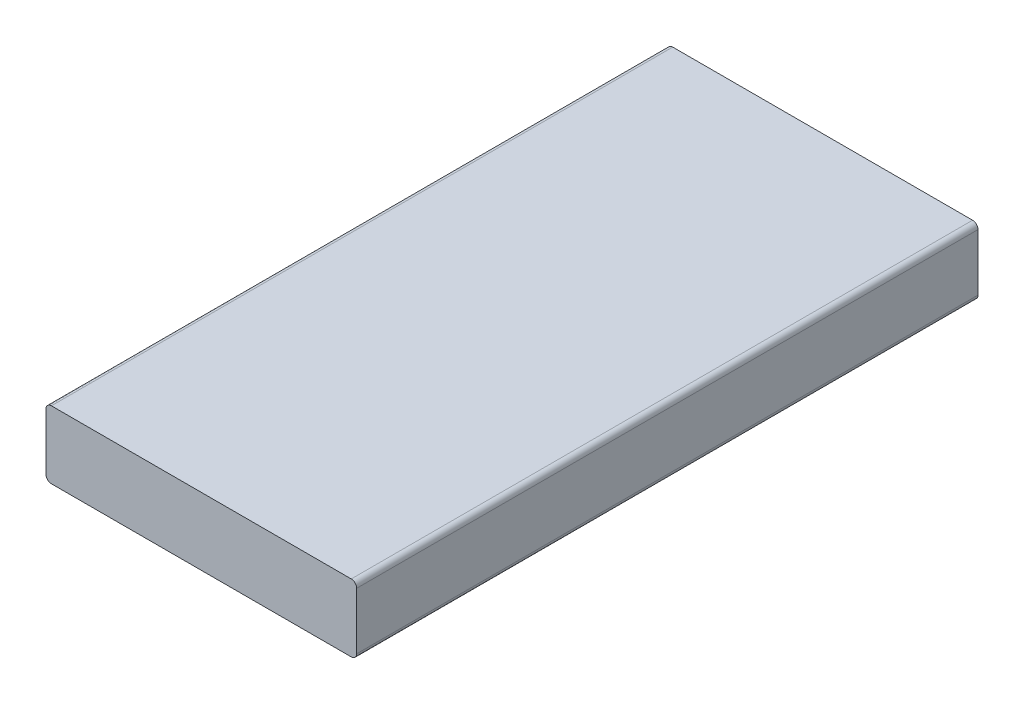
ISO-10303-21;
HEADER;
FILE_DESCRIPTION(('STEP AP214'),'2;1');
FILE_NAME('part.step','',(''),(''),'','','');
FILE_SCHEMA(('AUTOMOTIVE_DESIGN { 1 0 10303 214 1 1 1 1 }'));
ENDSEC;
DATA;
#1=APPLICATION_CONTEXT('core data for automotive mechanical design processes');
#2=APPLICATION_PROTOCOL_DEFINITION('international standard','automotive_design',2000,#1);
#3=PRODUCT_CONTEXT('',#1,'mechanical');
#4=PRODUCT('Part','Part','',(#3));
#5=PRODUCT_RELATED_PRODUCT_CATEGORY('part','',(#4));
#6=PRODUCT_DEFINITION_FORMATION('','',#4);
#7=PRODUCT_DEFINITION_CONTEXT('part definition',#1,'design');
#8=PRODUCT_DEFINITION('design','',#6,#7);
#9=PRODUCT_DEFINITION_SHAPE('','',#8);
#10=(LENGTH_UNIT() NAMED_UNIT(*) SI_UNIT(.MILLI.,.METRE.));
#11=(NAMED_UNIT(*) PLANE_ANGLE_UNIT() SI_UNIT($,.RADIAN.));
#12=(NAMED_UNIT(*) SI_UNIT($,.STERADIAN.) SOLID_ANGLE_UNIT());
#13=UNCERTAINTY_MEASURE_WITH_UNIT(LENGTH_MEASURE(1.E-05),#10,'distance_accuracy_value','');
#14=(GEOMETRIC_REPRESENTATION_CONTEXT(3) GLOBAL_UNCERTAINTY_ASSIGNED_CONTEXT((#13)) GLOBAL_UNIT_ASSIGNED_CONTEXT((#10,
#11,#12)) REPRESENTATION_CONTEXT('',''));
#15=CARTESIAN_POINT('',(0.,0.,0.));
#16=DIRECTION('',(0.,0.,1.));
#17=DIRECTION('',(1.,0.,0.));
#18=AXIS2_PLACEMENT_3D('',#15,#16,#17);
#19=CARTESIAN_POINT('',(-29.3402777777778,15.8854166666667,-230.));
#20=DIRECTION('',(-1.,0.,0.));
#21=DIRECTION('',(0.,0.,1.));
#22=AXIS2_PLACEMENT_3D('',#19,#20,#21);
#23=PLANE('',#22);
#24=DIRECTION('',(0.,-1.,0.));
#25=VECTOR('',#24,1.);
#26=CARTESIAN_POINT('',(-29.3402777777778,15.8854166666667,-230.));
#27=LINE('',#26,#25);
#28=CARTESIAN_POINT('',(-29.3402777777778,13.8854166666667,-230.));
#29=VERTEX_POINT('',#28);
#30=CARTESIAN_POINT('',(-29.3402777777778,-7.11458333333333,-230.));
#31=VERTEX_POINT('',#30);
#32=EDGE_CURVE('E179',#29,#31,#27,.T.);
#33=ORIENTED_EDGE('',*,*,#32,.T.);
#34=DIRECTION('',(0.,0.,1.));
#35=VECTOR('',#34,1.);
#36=CARTESIAN_POINT('',(-29.3402777777778,-7.11458333333333,-230.));
#37=LINE('',#36,#35);
#38=CARTESIAN_POINT('',(-29.3402777777778,-7.11458333333333,0.));
#39=VERTEX_POINT('',#38);
#40=EDGE_CURVE('E11',#31,#39,#37,.T.);
#41=ORIENTED_EDGE('',*,*,#40,.T.);
#42=DIRECTION('',(0.,-1.,0.));
#43=VECTOR('',#42,1.);
#44=CARTESIAN_POINT('',(-29.3402777777778,15.8854166666667,0.));
#45=LINE('',#44,#43);
#46=CARTESIAN_POINT('',(-29.3402777777778,13.8854166666667,0.));
#47=VERTEX_POINT('',#46);
#48=EDGE_CURVE('E112',#47,#39,#45,.T.);
#49=ORIENTED_EDGE('',*,*,#48,.F.);
#50=DIRECTION('',(0.,0.,1.));
#51=VECTOR('',#50,1.);
#52=CARTESIAN_POINT('',(-29.3402777777778,13.8854166666667,-230.));
#53=LINE('',#52,#51);
#54=EDGE_CURVE('E48',#47,#29,#53,.F.);
#55=ORIENTED_EDGE('',*,*,#54,.T.);
#56=EDGE_LOOP('',(#33,#41,#49,#55));
#57=FACE_BOUND('',#56,.T.);
#58=ADVANCED_FACE('F39',(#57),#23,.T.);
#59=CARTESIAN_POINT('',(-29.3402777777778,15.8854166666667,-230.));
#60=DIRECTION('',(0.,1.,0.));
#61=DIRECTION('',(0.,0.,1.));
#62=AXIS2_PLACEMENT_3D('',#59,#60,#61);
#63=PLANE('',#62);
#64=DIRECTION('',(-1.,0.,0.));
#65=VECTOR('',#64,1.);
#66=CARTESIAN_POINT('',(-29.3402777777778,15.8854166666667,0.));
#67=LINE('',#66,#65);
#68=CARTESIAN_POINT('',(83.6597222222222,15.8854166666667,0.));
#69=VERTEX_POINT('',#68);
#70=CARTESIAN_POINT('',(-27.3402777777778,15.8854166666667,0.));
#71=VERTEX_POINT('',#70);
#72=EDGE_CURVE('E143',#69,#71,#67,.T.);
#73=ORIENTED_EDGE('',*,*,#72,.F.);
#74=DIRECTION('',(0.,0.,1.));
#75=VECTOR('',#74,1.);
#76=CARTESIAN_POINT('',(83.6597222222222,15.8854166666667,-230.));
#77=LINE('',#76,#75);
#78=CARTESIAN_POINT('',(83.6597222222222,15.8854166666667,-230.));
#79=VERTEX_POINT('',#78);
#80=EDGE_CURVE('E62',#69,#79,#77,.F.);
#81=ORIENTED_EDGE('',*,*,#80,.T.);
#82=DIRECTION('',(-1.,0.,0.));
#83=VECTOR('',#82,1.);
#84=CARTESIAN_POINT('',(-29.3402777777778,15.8854166666667,-230.));
#85=LINE('',#84,#83);
#86=CARTESIAN_POINT('',(-27.3402777777778,15.8854166666667,-230.));
#87=VERTEX_POINT('',#86);
#88=EDGE_CURVE('E135',#79,#87,#85,.T.);
#89=ORIENTED_EDGE('',*,*,#88,.T.);
#90=DIRECTION('',(0.,0.,1.));
#91=VECTOR('',#90,1.);
#92=CARTESIAN_POINT('',(-27.3402777777778,15.8854166666667,-230.));
#93=LINE('',#92,#91);
#94=EDGE_CURVE('E170',#87,#71,#93,.T.);
#95=ORIENTED_EDGE('',*,*,#94,.T.);
#96=EDGE_LOOP('',(#73,#81,#89,#95));
#97=FACE_BOUND('',#96,.T.);
#98=ADVANCED_FACE('F188',(#97),#63,.T.);
#99=CARTESIAN_POINT('',(85.6597222222222,15.8854166666667,-230.));
#100=DIRECTION('',(1.,0.,0.));
#101=DIRECTION('',(0.,0.,-1.));
#102=AXIS2_PLACEMENT_3D('',#99,#100,#101);
#103=PLANE('',#102);
#104=DIRECTION('',(0.,1.,0.));
#105=VECTOR('',#104,1.);
#106=CARTESIAN_POINT('',(85.6597222222222,15.8854166666667,0.));
#107=LINE('',#106,#105);
#108=CARTESIAN_POINT('',(85.6597222222222,-7.11458333333333,0.));
#109=VERTEX_POINT('',#108);
#110=CARTESIAN_POINT('',(85.6597222222222,13.8854166666667,0.));
#111=VERTEX_POINT('',#110);
#112=EDGE_CURVE('E129',#109,#111,#107,.T.);
#113=ORIENTED_EDGE('',*,*,#112,.F.);
#114=DIRECTION('',(0.,0.,1.));
#115=VECTOR('',#114,1.);
#116=CARTESIAN_POINT('',(85.6597222222222,-7.11458333333333,-230.));
#117=LINE('',#116,#115);
#118=CARTESIAN_POINT('',(85.6597222222222,-7.11458333333333,-230.));
#119=VERTEX_POINT('',#118);
#120=EDGE_CURVE('E157',#109,#119,#117,.F.);
#121=ORIENTED_EDGE('',*,*,#120,.T.);
#122=DIRECTION('',(0.,1.,0.));
#123=VECTOR('',#122,1.);
#124=CARTESIAN_POINT('',(85.6597222222222,15.8854166666667,-230.));
#125=LINE('',#124,#123);
#126=CARTESIAN_POINT('',(85.6597222222222,13.8854166666667,-230.));
#127=VERTEX_POINT('',#126);
#128=EDGE_CURVE('E140',#119,#127,#125,.T.);
#129=ORIENTED_EDGE('',*,*,#128,.T.);
#130=DIRECTION('',(0.,0.,1.));
#131=VECTOR('',#130,1.);
#132=CARTESIAN_POINT('',(85.6597222222222,13.8854166666667,-230.));
#133=LINE('',#132,#131);
#134=EDGE_CURVE('E153',#127,#111,#133,.T.);
#135=ORIENTED_EDGE('',*,*,#134,.T.);
#136=EDGE_LOOP('',(#113,#121,#129,#135));
#137=FACE_BOUND('',#136,.T.);
#138=ADVANCED_FACE('F205',(#137),#103,.T.);
#139=CARTESIAN_POINT('',(-29.3402777777778,-9.11458333333333,-230.));
#140=DIRECTION('',(0.,-1.,0.));
#141=DIRECTION('',(0.,0.,-1.));
#142=AXIS2_PLACEMENT_3D('',#139,#140,#141);
#143=PLANE('',#142);
#144=DIRECTION('',(1.,0.,0.));
#145=VECTOR('',#144,1.);
#146=CARTESIAN_POINT('',(-29.3402777777778,-9.11458333333333,-230.));
#147=LINE('',#146,#145);
#148=CARTESIAN_POINT('',(-27.3402777777778,-9.11458333333333,-230.));
#149=VERTEX_POINT('',#148);
#150=CARTESIAN_POINT('',(83.6597222222222,-9.11458333333333,-230.));
#151=VERTEX_POINT('',#150);
#152=EDGE_CURVE('E184',#149,#151,#147,.T.);
#153=ORIENTED_EDGE('',*,*,#152,.T.);
#154=DIRECTION('',(0.,0.,1.));
#155=VECTOR('',#154,1.);
#156=CARTESIAN_POINT('',(83.6597222222222,-9.11458333333333,-230.));
#157=LINE('',#156,#155);
#158=CARTESIAN_POINT('',(83.6597222222222,-9.11458333333333,0.));
#159=VERTEX_POINT('',#158);
#160=EDGE_CURVE('E127',#151,#159,#157,.T.);
#161=ORIENTED_EDGE('',*,*,#160,.T.);
#162=DIRECTION('',(1.,0.,0.));
#163=VECTOR('',#162,1.);
#164=CARTESIAN_POINT('',(-29.3402777777778,-9.11458333333333,0.));
#165=LINE('',#164,#163);
#166=CARTESIAN_POINT('',(-27.3402777777778,-9.11458333333333,0.));
#167=VERTEX_POINT('',#166);
#168=EDGE_CURVE('E110',#167,#159,#165,.T.);
#169=ORIENTED_EDGE('',*,*,#168,.F.);
#170=DIRECTION('',(0.,0.,1.));
#171=VECTOR('',#170,1.);
#172=CARTESIAN_POINT('',(-27.3402777777778,-9.11458333333333,-230.));
#173=LINE('',#172,#171);
#174=EDGE_CURVE('E124',#167,#149,#173,.F.);
#175=ORIENTED_EDGE('',*,*,#174,.T.);
#176=EDGE_LOOP('',(#153,#161,#169,#175));
#177=FACE_BOUND('',#176,.T.);
#178=ADVANCED_FACE('F123',(#177),#143,.T.);
#179=CARTESIAN_POINT('',(0.,0.,-230.));
#180=DIRECTION('',(0.,0.,1.));
#181=DIRECTION('',(1.,0.,0.));
#182=AXIS2_PLACEMENT_3D('',#179,#180,#181);
#183=PLANE('',#182);
#184=ORIENTED_EDGE('',*,*,#128,.F.);
#185=CARTESIAN_POINT('',(83.6597222222222,-7.11458333333333,-230.));
#186=DIRECTION('',(0.,0.,1.));
#187=DIRECTION('',(1.,0.,0.));
#188=AXIS2_PLACEMENT_3D('',#185,#186,#187);
#189=CIRCLE('',#188,2.);
#190=EDGE_CURVE('E167',#119,#151,#189,.F.);
#191=ORIENTED_EDGE('',*,*,#190,.T.);
#192=ORIENTED_EDGE('',*,*,#152,.F.);
#193=CARTESIAN_POINT('',(-27.3402777777778,-7.11458333333333,-230.));
#194=DIRECTION('',(0.,0.,1.));
#195=DIRECTION('',(1.,0.,0.));
#196=AXIS2_PLACEMENT_3D('',#193,#194,#195);
#197=CIRCLE('',#196,2.);
#198=EDGE_CURVE('E133',#149,#31,#197,.F.);
#199=ORIENTED_EDGE('',*,*,#198,.T.);
#200=ORIENTED_EDGE('',*,*,#32,.F.);
#201=CARTESIAN_POINT('',(-27.3402777777778,13.8854166666667,-230.));
#202=DIRECTION('',(0.,0.,1.));
#203=DIRECTION('',(1.,0.,0.));
#204=AXIS2_PLACEMENT_3D('',#201,#202,#203);
#205=CIRCLE('',#204,2.);
#206=EDGE_CURVE('E55',#29,#87,#205,.F.);
#207=ORIENTED_EDGE('',*,*,#206,.T.);
#208=ORIENTED_EDGE('',*,*,#88,.F.);
#209=CARTESIAN_POINT('',(83.6597222222222,13.8854166666667,-230.));
#210=DIRECTION('',(0.,0.,1.));
#211=DIRECTION('',(1.,0.,0.));
#212=AXIS2_PLACEMENT_3D('',#209,#210,#211);
#213=CIRCLE('',#212,2.);
#214=EDGE_CURVE('E164',#79,#127,#213,.F.);
#215=ORIENTED_EDGE('',*,*,#214,.T.);
#216=EDGE_LOOP('',(#184,#191,#192,#199,#200,#207,#208,#215));
#217=FACE_BOUND('',#216,.T.);
#218=ADVANCED_FACE('F182',(#217),#183,.F.);
#219=CARTESIAN_POINT('',(0.,0.,0.));
#220=DIRECTION('',(0.,0.,1.));
#221=DIRECTION('',(1.,0.,0.));
#222=AXIS2_PLACEMENT_3D('',#219,#220,#221);
#223=PLANE('',#222);
#224=ORIENTED_EDGE('',*,*,#168,.T.);
#225=CARTESIAN_POINT('',(83.6597222222222,-7.11458333333333,0.));
#226=DIRECTION('',(0.,0.,1.));
#227=DIRECTION('',(1.,0.,0.));
#228=AXIS2_PLACEMENT_3D('',#225,#226,#227);
#229=CIRCLE('',#228,2.);
#230=EDGE_CURVE('E150',#159,#109,#229,.T.);
#231=ORIENTED_EDGE('',*,*,#230,.T.);
#232=ORIENTED_EDGE('',*,*,#112,.T.);
#233=CARTESIAN_POINT('',(83.6597222222222,13.8854166666667,0.));
#234=DIRECTION('',(0.,0.,1.));
#235=DIRECTION('',(1.,0.,0.));
#236=AXIS2_PLACEMENT_3D('',#233,#234,#235);
#237=CIRCLE('',#236,2.);
#238=EDGE_CURVE('E117',#111,#69,#237,.T.);
#239=ORIENTED_EDGE('',*,*,#238,.T.);
#240=ORIENTED_EDGE('',*,*,#72,.T.);
#241=CARTESIAN_POINT('',(-27.3402777777778,13.8854166666667,0.));
#242=DIRECTION('',(0.,0.,1.));
#243=DIRECTION('',(1.,0.,0.));
#244=AXIS2_PLACEMENT_3D('',#241,#242,#243);
#245=CIRCLE('',#244,2.);
#246=EDGE_CURVE('E118',#71,#47,#245,.T.);
#247=ORIENTED_EDGE('',*,*,#246,.T.);
#248=ORIENTED_EDGE('',*,*,#48,.T.);
#249=CARTESIAN_POINT('',(-27.3402777777778,-7.11458333333333,0.));
#250=DIRECTION('',(0.,0.,1.));
#251=DIRECTION('',(1.,0.,0.));
#252=AXIS2_PLACEMENT_3D('',#249,#250,#251);
#253=CIRCLE('',#252,2.);
#254=EDGE_CURVE('E107',#39,#167,#253,.T.);
#255=ORIENTED_EDGE('',*,*,#254,.T.);
#256=EDGE_LOOP('',(#224,#231,#232,#239,#240,#247,#248,#255));
#257=FACE_BOUND('',#256,.T.);
#258=ADVANCED_FACE('F109',(#257),#223,.T.);
#259=CARTESIAN_POINT('',(83.6597222222222,-7.11458333333333,-230.));
#260=DIRECTION('',(0.,0.,1.));
#261=DIRECTION('',(1.,0.,0.));
#262=AXIS2_PLACEMENT_3D('',#259,#260,#261);
#263=CYLINDRICAL_SURFACE('',#262,2.);
#264=ORIENTED_EDGE('',*,*,#190,.F.);
#265=ORIENTED_EDGE('',*,*,#120,.F.);
#266=ORIENTED_EDGE('',*,*,#230,.F.);
#267=ORIENTED_EDGE('',*,*,#160,.F.);
#268=EDGE_LOOP('',(#264,#265,#266,#267));
#269=FACE_BOUND('',#268,.T.);
#270=ADVANCED_FACE('F202',(#269),#263,.T.);
#271=CARTESIAN_POINT('',(83.6597222222222,13.8854166666667,-230.));
#272=DIRECTION('',(0.,0.,1.));
#273=DIRECTION('',(1.,0.,0.));
#274=AXIS2_PLACEMENT_3D('',#271,#272,#273);
#275=CYLINDRICAL_SURFACE('',#274,2.);
#276=ORIENTED_EDGE('',*,*,#214,.F.);
#277=ORIENTED_EDGE('',*,*,#80,.F.);
#278=ORIENTED_EDGE('',*,*,#238,.F.);
#279=ORIENTED_EDGE('',*,*,#134,.F.);
#280=EDGE_LOOP('',(#276,#277,#278,#279));
#281=FACE_BOUND('',#280,.T.);
#282=ADVANCED_FACE('F209',(#281),#275,.T.);
#283=CARTESIAN_POINT('',(-27.3402777777778,-7.11458333333333,-230.));
#284=DIRECTION('',(0.,0.,1.));
#285=DIRECTION('',(1.,0.,0.));
#286=AXIS2_PLACEMENT_3D('',#283,#284,#285);
#287=CYLINDRICAL_SURFACE('',#286,2.);
#288=ORIENTED_EDGE('',*,*,#198,.F.);
#289=ORIENTED_EDGE('',*,*,#174,.F.);
#290=ORIENTED_EDGE('',*,*,#254,.F.);
#291=ORIENTED_EDGE('',*,*,#40,.F.);
#292=EDGE_LOOP('',(#288,#289,#290,#291));
#293=FACE_BOUND('',#292,.T.);
#294=ADVANCED_FACE('F132',(#293),#287,.T.);
#295=CARTESIAN_POINT('',(-27.3402777777778,13.8854166666667,-230.));
#296=DIRECTION('',(0.,0.,1.));
#297=DIRECTION('',(1.,0.,0.));
#298=AXIS2_PLACEMENT_3D('',#295,#296,#297);
#299=CYLINDRICAL_SURFACE('',#298,2.);
#300=ORIENTED_EDGE('',*,*,#206,.F.);
#301=ORIENTED_EDGE('',*,*,#54,.F.);
#302=ORIENTED_EDGE('',*,*,#246,.F.);
#303=ORIENTED_EDGE('',*,*,#94,.F.);
#304=EDGE_LOOP('',(#300,#301,#302,#303));
#305=FACE_BOUND('',#304,.T.);
#306=ADVANCED_FACE('F41',(#305),#299,.T.);
#307=CLOSED_SHELL('',(#58,#98,#138,#178,#218,#258,#270,#282,#294,#306));
#308=MANIFOLD_SOLID_BREP('B2',#307);
#309=ADVANCED_BREP_SHAPE_REPRESENTATION('',(#18,#308),#14);
#310=SHAPE_DEFINITION_REPRESENTATION(#9,#309);
ENDSEC;
END-ISO-10303-21;
